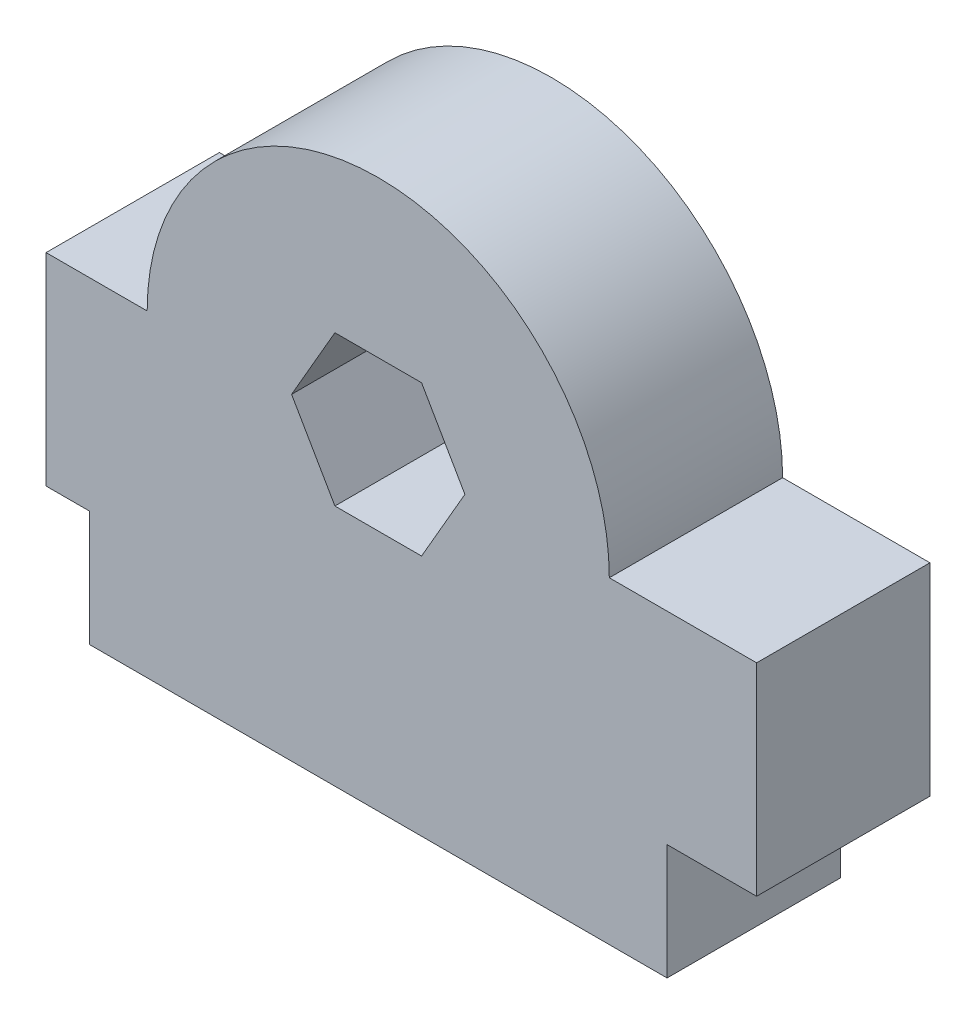
ISO-10303-21;
HEADER;
FILE_DESCRIPTION(('STEP AP214'),'2;1');
FILE_NAME('part.step','',(''),(''),'','','');
FILE_SCHEMA(('AUTOMOTIVE_DESIGN { 1 0 10303 214 1 1 1 1 }'));
ENDSEC;
DATA;
#1=APPLICATION_CONTEXT('core data for automotive mechanical design processes');
#2=APPLICATION_PROTOCOL_DEFINITION('international standard','automotive_design',2000,#1);
#3=PRODUCT_CONTEXT('',#1,'mechanical');
#4=PRODUCT('Part','Part','',(#3));
#5=PRODUCT_RELATED_PRODUCT_CATEGORY('part','',(#4));
#6=PRODUCT_DEFINITION_FORMATION('','',#4);
#7=PRODUCT_DEFINITION_CONTEXT('part definition',#1,'design');
#8=PRODUCT_DEFINITION('design','',#6,#7);
#9=PRODUCT_DEFINITION_SHAPE('','',#8);
#10=(LENGTH_UNIT() NAMED_UNIT(*) SI_UNIT(.MILLI.,.METRE.));
#11=(NAMED_UNIT(*) PLANE_ANGLE_UNIT() SI_UNIT($,.RADIAN.));
#12=(NAMED_UNIT(*) SI_UNIT($,.STERADIAN.) SOLID_ANGLE_UNIT());
#13=UNCERTAINTY_MEASURE_WITH_UNIT(LENGTH_MEASURE(1.E-05),#10,'distance_accuracy_value','');
#14=(GEOMETRIC_REPRESENTATION_CONTEXT(3) GLOBAL_UNCERTAINTY_ASSIGNED_CONTEXT((#13)) GLOBAL_UNIT_ASSIGNED_CONTEXT((#10,
#11,#12)) REPRESENTATION_CONTEXT('',''));
#15=CARTESIAN_POINT('',(0.,0.,0.));
#16=DIRECTION('',(0.,0.,1.));
#17=DIRECTION('',(1.,0.,0.));
#18=AXIS2_PLACEMENT_3D('',#15,#16,#17);
#19=CARTESIAN_POINT('',(10.,11.,6.));
#20=DIRECTION('',(0.,0.,1.));
#21=DIRECTION('',(1.,0.,0.));
#22=AXIS2_PLACEMENT_3D('',#19,#20,#21);
#23=PLANE('',#22);
#24=DIRECTION('',(0.,-1.,0.));
#25=VECTOR('',#24,1.);
#26=CARTESIAN_POINT('',(0.,0.,6.));
#27=LINE('',#26,#25);
#28=CARTESIAN_POINT('',(0.,4.,6.));
#29=VERTEX_POINT('',#28);
#30=CARTESIAN_POINT('',(0.,0.,6.));
#31=VERTEX_POINT('',#30);
#32=EDGE_CURVE('E199',#29,#31,#27,.T.);
#33=ORIENTED_EDGE('',*,*,#32,.T.);
#34=DIRECTION('',(1.,0.,0.));
#35=VECTOR('',#34,1.);
#36=CARTESIAN_POINT('',(0.,0.,6.));
#37=LINE('',#36,#35);
#38=CARTESIAN_POINT('',(20.,0.,6.));
#39=VERTEX_POINT('',#38);
#40=EDGE_CURVE('E202',#31,#39,#37,.T.);
#41=ORIENTED_EDGE('',*,*,#40,.T.);
#42=DIRECTION('',(0.,1.,0.));
#43=VECTOR('',#42,1.);
#44=CARTESIAN_POINT('',(20.,0.,6.));
#45=LINE('',#44,#43);
#46=CARTESIAN_POINT('',(20.,4.,6.));
#47=VERTEX_POINT('',#46);
#48=EDGE_CURVE('E205',#39,#47,#45,.T.);
#49=ORIENTED_EDGE('',*,*,#48,.T.);
#50=DIRECTION('',(1.,0.,0.));
#51=VECTOR('',#50,1.);
#52=CARTESIAN_POINT('',(23.1,4.,6.));
#53=LINE('',#52,#51);
#54=CARTESIAN_POINT('',(23.1,4.,6.));
#55=VERTEX_POINT('',#54);
#56=EDGE_CURVE('E207',#47,#55,#53,.T.);
#57=ORIENTED_EDGE('',*,*,#56,.T.);
#58=DIRECTION('',(0.,1.,0.));
#59=VECTOR('',#58,1.);
#60=CARTESIAN_POINT('',(23.1,11.,6.));
#61=LINE('',#60,#59);
#62=CARTESIAN_POINT('',(23.1,11.,6.));
#63=VERTEX_POINT('',#62);
#64=EDGE_CURVE('E209',#55,#63,#61,.T.);
#65=ORIENTED_EDGE('',*,*,#64,.T.);
#66=DIRECTION('',(-1.,0.,0.));
#67=VECTOR('',#66,1.);
#68=CARTESIAN_POINT('',(18.,11.,6.));
#69=LINE('',#68,#67);
#70=CARTESIAN_POINT('',(18.,11.,6.));
#71=VERTEX_POINT('',#70);
#72=EDGE_CURVE('E211',#63,#71,#69,.T.);
#73=ORIENTED_EDGE('',*,*,#72,.T.);
#74=CARTESIAN_POINT('',(10.,11.,6.));
#75=DIRECTION('',(0.,0.,1.));
#76=DIRECTION('',(1.,0.,0.));
#77=AXIS2_PLACEMENT_3D('',#74,#75,#76);
#78=CIRCLE('',#77,8.);
#79=CARTESIAN_POINT('',(2.,11.,6.));
#80=VERTEX_POINT('',#79);
#81=EDGE_CURVE('E213',#71,#80,#78,.T.);
#82=ORIENTED_EDGE('',*,*,#81,.T.);
#83=DIRECTION('',(-1.,0.,0.));
#84=VECTOR('',#83,1.);
#85=CARTESIAN_POINT('',(-1.5,11.,6.));
#86=LINE('',#85,#84);
#87=CARTESIAN_POINT('',(-1.5,11.,6.));
#88=VERTEX_POINT('',#87);
#89=EDGE_CURVE('E215',#80,#88,#86,.T.);
#90=ORIENTED_EDGE('',*,*,#89,.T.);
#91=DIRECTION('',(0.,-1.,0.));
#92=VECTOR('',#91,1.);
#93=CARTESIAN_POINT('',(-1.5,4.,6.));
#94=LINE('',#93,#92);
#95=CARTESIAN_POINT('',(-1.5,4.,6.));
#96=VERTEX_POINT('',#95);
#97=EDGE_CURVE('E217',#88,#96,#94,.T.);
#98=ORIENTED_EDGE('',*,*,#97,.T.);
#99=DIRECTION('',(1.,0.,0.));
#100=VECTOR('',#99,1.);
#101=CARTESIAN_POINT('',(0.,4.,6.));
#102=LINE('',#101,#100);
#103=EDGE_CURVE('E219',#96,#29,#102,.T.);
#104=ORIENTED_EDGE('',*,*,#103,.T.);
#105=EDGE_LOOP('',(#33,#41,#49,#57,#65,#73,#82,#90,#98,#104));
#106=FACE_BOUND('',#105,.T.);
#107=DIRECTION('',(-0.500000000000001,0.866025403784438,0.));
#108=VECTOR('',#107,1.);
#109=CARTESIAN_POINT('',(13.,11.,6.));
#110=LINE('',#109,#108);
#111=CARTESIAN_POINT('',(13.,11.,6.));
#112=VERTEX_POINT('',#111);
#113=CARTESIAN_POINT('',(11.5,13.5980762113533,6.));
#114=VERTEX_POINT('',#113);
#115=EDGE_CURVE('E156',#112,#114,#110,.T.);
#116=ORIENTED_EDGE('',*,*,#115,.F.);
#117=DIRECTION('',(0.499999999999995,0.866025403784441,0.));
#118=VECTOR('',#117,1.);
#119=CARTESIAN_POINT('',(11.5,8.4019237886467,6.));
#120=LINE('',#119,#118);
#121=CARTESIAN_POINT('',(11.5,8.4019237886467,6.));
#122=VERTEX_POINT('',#121);
#123=EDGE_CURVE('E148',#122,#112,#120,.T.);
#124=ORIENTED_EDGE('',*,*,#123,.F.);
#125=DIRECTION('',(1.,0.,0.));
#126=VECTOR('',#125,1.);
#127=CARTESIAN_POINT('',(8.50000000000002,8.40192378864667,6.));
#128=LINE('',#127,#126);
#129=CARTESIAN_POINT('',(8.50000000000002,8.40192378864667,6.));
#130=VERTEX_POINT('',#129);
#131=EDGE_CURVE('E177',#130,#122,#128,.T.);
#132=ORIENTED_EDGE('',*,*,#131,.F.);
#133=DIRECTION('',(0.500000000000007,-0.866025403784435,0.));
#134=VECTOR('',#133,1.);
#135=CARTESIAN_POINT('',(7.,11.,6.));
#136=LINE('',#135,#134);
#137=CARTESIAN_POINT('',(7.,11.,6.));
#138=VERTEX_POINT('',#137);
#139=EDGE_CURVE('E175',#138,#130,#136,.T.);
#140=ORIENTED_EDGE('',*,*,#139,.F.);
#141=DIRECTION('',(-0.499999999999995,-0.866025403784441,0.));
#142=VECTOR('',#141,1.);
#143=CARTESIAN_POINT('',(8.49999999999999,13.5980762113533,6.));
#144=LINE('',#143,#142);
#145=CARTESIAN_POINT('',(8.49999999999999,13.5980762113533,6.));
#146=VERTEX_POINT('',#145);
#147=EDGE_CURVE('E171',#146,#138,#144,.T.);
#148=ORIENTED_EDGE('',*,*,#147,.F.);
#149=DIRECTION('',(-1.,0.,0.));
#150=VECTOR('',#149,1.);
#151=CARTESIAN_POINT('',(11.5,13.5980762113533,6.));
#152=LINE('',#151,#150);
#153=EDGE_CURVE('E169',#114,#146,#152,.T.);
#154=ORIENTED_EDGE('',*,*,#153,.F.);
#155=EDGE_LOOP('',(#116,#124,#132,#140,#148,#154));
#156=FACE_BOUND('',#155,.T.);
#157=ADVANCED_FACE('F35',(#106,#156),#23,.T.);
#158=CARTESIAN_POINT('',(10.,11.,0.));
#159=DIRECTION('',(0.,0.,1.));
#160=DIRECTION('',(1.,0.,0.));
#161=AXIS2_PLACEMENT_3D('',#158,#159,#160);
#162=PLANE('',#161);
#163=DIRECTION('',(0.,-1.,0.));
#164=VECTOR('',#163,1.);
#165=CARTESIAN_POINT('',(0.,0.,0.));
#166=LINE('',#165,#164);
#167=CARTESIAN_POINT('',(0.,4.,0.));
#168=VERTEX_POINT('',#167);
#169=CARTESIAN_POINT('',(0.,0.,0.));
#170=VERTEX_POINT('',#169);
#171=EDGE_CURVE('E164',#168,#170,#166,.T.);
#172=ORIENTED_EDGE('',*,*,#171,.F.);
#173=DIRECTION('',(1.,0.,0.));
#174=VECTOR('',#173,1.);
#175=CARTESIAN_POINT('',(0.,4.,0.));
#176=LINE('',#175,#174);
#177=CARTESIAN_POINT('',(-1.5,4.,0.));
#178=VERTEX_POINT('',#177);
#179=EDGE_CURVE('E203',#178,#168,#176,.T.);
#180=ORIENTED_EDGE('',*,*,#179,.F.);
#181=DIRECTION('',(0.,-1.,0.));
#182=VECTOR('',#181,1.);
#183=CARTESIAN_POINT('',(-1.5,4.,0.));
#184=LINE('',#183,#182);
#185=CARTESIAN_POINT('',(-1.5,11.,0.));
#186=VERTEX_POINT('',#185);
#187=EDGE_CURVE('E238',#186,#178,#184,.T.);
#188=ORIENTED_EDGE('',*,*,#187,.F.);
#189=DIRECTION('',(-1.,0.,0.));
#190=VECTOR('',#189,1.);
#191=CARTESIAN_POINT('',(-1.5,11.,0.));
#192=LINE('',#191,#190);
#193=CARTESIAN_POINT('',(2.,11.,0.));
#194=VERTEX_POINT('',#193);
#195=EDGE_CURVE('E236',#194,#186,#192,.T.);
#196=ORIENTED_EDGE('',*,*,#195,.F.);
#197=CARTESIAN_POINT('',(10.,11.,0.));
#198=DIRECTION('',(0.,0.,1.));
#199=DIRECTION('',(1.,0.,0.));
#200=AXIS2_PLACEMENT_3D('',#197,#198,#199);
#201=CIRCLE('',#200,8.);
#202=CARTESIAN_POINT('',(18.,11.,0.));
#203=VERTEX_POINT('',#202);
#204=EDGE_CURVE('E234',#203,#194,#201,.T.);
#205=ORIENTED_EDGE('',*,*,#204,.F.);
#206=DIRECTION('',(-1.,0.,0.));
#207=VECTOR('',#206,1.);
#208=CARTESIAN_POINT('',(18.,11.,0.));
#209=LINE('',#208,#207);
#210=CARTESIAN_POINT('',(23.1,11.,0.));
#211=VERTEX_POINT('',#210);
#212=EDGE_CURVE('E232',#211,#203,#209,.T.);
#213=ORIENTED_EDGE('',*,*,#212,.F.);
#214=DIRECTION('',(0.,1.,0.));
#215=VECTOR('',#214,1.);
#216=CARTESIAN_POINT('',(23.1,11.,0.));
#217=LINE('',#216,#215);
#218=CARTESIAN_POINT('',(23.1,4.,0.));
#219=VERTEX_POINT('',#218);
#220=EDGE_CURVE('E230',#219,#211,#217,.T.);
#221=ORIENTED_EDGE('',*,*,#220,.F.);
#222=DIRECTION('',(1.,0.,0.));
#223=VECTOR('',#222,1.);
#224=CARTESIAN_POINT('',(23.1,4.,0.));
#225=LINE('',#224,#223);
#226=CARTESIAN_POINT('',(20.,4.,0.));
#227=VERTEX_POINT('',#226);
#228=EDGE_CURVE('E228',#227,#219,#225,.T.);
#229=ORIENTED_EDGE('',*,*,#228,.F.);
#230=DIRECTION('',(0.,1.,0.));
#231=VECTOR('',#230,1.);
#232=CARTESIAN_POINT('',(20.,0.,0.));
#233=LINE('',#232,#231);
#234=CARTESIAN_POINT('',(20.,0.,0.));
#235=VERTEX_POINT('',#234);
#236=EDGE_CURVE('E226',#235,#227,#233,.T.);
#237=ORIENTED_EDGE('',*,*,#236,.F.);
#238=DIRECTION('',(1.,0.,0.));
#239=VECTOR('',#238,1.);
#240=CARTESIAN_POINT('',(0.,0.,0.));
#241=LINE('',#240,#239);
#242=EDGE_CURVE('E224',#170,#235,#241,.T.);
#243=ORIENTED_EDGE('',*,*,#242,.F.);
#244=EDGE_LOOP('',(#172,#180,#188,#196,#205,#213,#221,#229,#237,#243));
#245=FACE_BOUND('',#244,.T.);
#246=DIRECTION('',(0.499999999999995,0.866025403784441,0.));
#247=VECTOR('',#246,1.);
#248=CARTESIAN_POINT('',(11.5,8.4019237886467,0.));
#249=LINE('',#248,#247);
#250=CARTESIAN_POINT('',(11.5,8.4019237886467,0.));
#251=VERTEX_POINT('',#250);
#252=CARTESIAN_POINT('',(13.,11.,0.));
#253=VERTEX_POINT('',#252);
#254=EDGE_CURVE('E58',#251,#253,#249,.T.);
#255=ORIENTED_EDGE('',*,*,#254,.T.);
#256=DIRECTION('',(-0.500000000000001,0.866025403784438,0.));
#257=VECTOR('',#256,1.);
#258=CARTESIAN_POINT('',(13.,11.,0.));
#259=LINE('',#258,#257);
#260=CARTESIAN_POINT('',(11.5,13.5980762113533,0.));
#261=VERTEX_POINT('',#260);
#262=EDGE_CURVE('E163',#253,#261,#259,.T.);
#263=ORIENTED_EDGE('',*,*,#262,.T.);
#264=DIRECTION('',(-1.,0.,0.));
#265=VECTOR('',#264,1.);
#266=CARTESIAN_POINT('',(11.5,13.5980762113533,0.));
#267=LINE('',#266,#265);
#268=CARTESIAN_POINT('',(8.49999999999999,13.5980762113533,0.));
#269=VERTEX_POINT('',#268);
#270=EDGE_CURVE('E181',#261,#269,#267,.T.);
#271=ORIENTED_EDGE('',*,*,#270,.T.);
#272=DIRECTION('',(-0.499999999999995,-0.866025403784441,0.));
#273=VECTOR('',#272,1.);
#274=CARTESIAN_POINT('',(8.49999999999999,13.5980762113533,0.));
#275=LINE('',#274,#273);
#276=CARTESIAN_POINT('',(7.,11.,0.));
#277=VERTEX_POINT('',#276);
#278=EDGE_CURVE('E184',#269,#277,#275,.T.);
#279=ORIENTED_EDGE('',*,*,#278,.T.);
#280=DIRECTION('',(0.500000000000007,-0.866025403784435,0.));
#281=VECTOR('',#280,1.);
#282=CARTESIAN_POINT('',(7.,11.,0.));
#283=LINE('',#282,#281);
#284=CARTESIAN_POINT('',(8.50000000000002,8.40192378864667,0.));
#285=VERTEX_POINT('',#284);
#286=EDGE_CURVE('E187',#277,#285,#283,.T.);
#287=ORIENTED_EDGE('',*,*,#286,.T.);
#288=DIRECTION('',(1.,0.,0.));
#289=VECTOR('',#288,1.);
#290=CARTESIAN_POINT('',(8.50000000000002,8.40192378864667,0.));
#291=LINE('',#290,#289);
#292=EDGE_CURVE('E157',#285,#251,#291,.T.);
#293=ORIENTED_EDGE('',*,*,#292,.T.);
#294=EDGE_LOOP('',(#255,#263,#271,#279,#287,#293));
#295=FACE_BOUND('',#294,.T.);
#296=ADVANCED_FACE('F274',(#245,#295),#162,.F.);
#297=CARTESIAN_POINT('',(0.,0.,6.));
#298=DIRECTION('',(1.,0.,0.));
#299=DIRECTION('',(0.,0.,-1.));
#300=AXIS2_PLACEMENT_3D('',#297,#298,#299);
#301=PLANE('',#300);
#302=ORIENTED_EDGE('',*,*,#171,.T.);
#303=DIRECTION('',(0.,0.,-1.));
#304=VECTOR('',#303,1.);
#305=CARTESIAN_POINT('',(0.,0.,6.));
#306=LINE('',#305,#304);
#307=EDGE_CURVE('E11',#31,#170,#306,.T.);
#308=ORIENTED_EDGE('',*,*,#307,.F.);
#309=ORIENTED_EDGE('',*,*,#32,.F.);
#310=DIRECTION('',(0.,0.,-1.));
#311=VECTOR('',#310,1.);
#312=CARTESIAN_POINT('',(0.,4.,6.));
#313=LINE('',#312,#311);
#314=EDGE_CURVE('E221',#29,#168,#313,.T.);
#315=ORIENTED_EDGE('',*,*,#314,.T.);
#316=EDGE_LOOP('',(#302,#308,#309,#315));
#317=FACE_BOUND('',#316,.T.);
#318=ADVANCED_FACE('F37',(#317),#301,.F.);
#319=CARTESIAN_POINT('',(0.,0.,6.));
#320=DIRECTION('',(0.,1.,0.));
#321=DIRECTION('',(0.,0.,1.));
#322=AXIS2_PLACEMENT_3D('',#319,#320,#321);
#323=PLANE('',#322);
#324=ORIENTED_EDGE('',*,*,#242,.T.);
#325=DIRECTION('',(0.,0.,-1.));
#326=VECTOR('',#325,1.);
#327=CARTESIAN_POINT('',(20.,0.,6.));
#328=LINE('',#327,#326);
#329=EDGE_CURVE('E43',#39,#235,#328,.T.);
#330=ORIENTED_EDGE('',*,*,#329,.F.);
#331=ORIENTED_EDGE('',*,*,#40,.F.);
#332=ORIENTED_EDGE('',*,*,#307,.T.);
#333=EDGE_LOOP('',(#324,#330,#331,#332));
#334=FACE_BOUND('',#333,.T.);
#335=ADVANCED_FACE('F291',(#334),#323,.F.);
#336=CARTESIAN_POINT('',(20.,0.,6.));
#337=DIRECTION('',(-1.,0.,0.));
#338=DIRECTION('',(0.,0.,1.));
#339=AXIS2_PLACEMENT_3D('',#336,#337,#338);
#340=PLANE('',#339);
#341=ORIENTED_EDGE('',*,*,#236,.T.);
#342=DIRECTION('',(0.,0.,-1.));
#343=VECTOR('',#342,1.);
#344=CARTESIAN_POINT('',(20.,4.,6.));
#345=LINE('',#344,#343);
#346=EDGE_CURVE('E261',#47,#227,#345,.T.);
#347=ORIENTED_EDGE('',*,*,#346,.F.);
#348=ORIENTED_EDGE('',*,*,#48,.F.);
#349=ORIENTED_EDGE('',*,*,#329,.T.);
#350=EDGE_LOOP('',(#341,#347,#348,#349));
#351=FACE_BOUND('',#350,.T.);
#352=ADVANCED_FACE('F268',(#351),#340,.F.);
#353=CARTESIAN_POINT('',(23.1,4.,6.));
#354=DIRECTION('',(0.,1.,0.));
#355=DIRECTION('',(-1.,0.,0.));
#356=AXIS2_PLACEMENT_3D('',#353,#354,#355);
#357=PLANE('',#356);
#358=ORIENTED_EDGE('',*,*,#228,.T.);
#359=DIRECTION('',(0.,0.,-1.));
#360=VECTOR('',#359,1.);
#361=CARTESIAN_POINT('',(23.1,4.,6.));
#362=LINE('',#361,#360);
#363=EDGE_CURVE('E258',#55,#219,#362,.T.);
#364=ORIENTED_EDGE('',*,*,#363,.F.);
#365=ORIENTED_EDGE('',*,*,#56,.F.);
#366=ORIENTED_EDGE('',*,*,#346,.T.);
#367=EDGE_LOOP('',(#358,#364,#365,#366));
#368=FACE_BOUND('',#367,.T.);
#369=ADVANCED_FACE('F280',(#368),#357,.F.);
#370=CARTESIAN_POINT('',(23.1,11.,6.));
#371=DIRECTION('',(-1.,0.,0.));
#372=DIRECTION('',(0.,0.,1.));
#373=AXIS2_PLACEMENT_3D('',#370,#371,#372);
#374=PLANE('',#373);
#375=ORIENTED_EDGE('',*,*,#220,.T.);
#376=DIRECTION('',(0.,0.,-1.));
#377=VECTOR('',#376,1.);
#378=CARTESIAN_POINT('',(23.1,11.,6.));
#379=LINE('',#378,#377);
#380=EDGE_CURVE('E255',#63,#211,#379,.T.);
#381=ORIENTED_EDGE('',*,*,#380,.F.);
#382=ORIENTED_EDGE('',*,*,#64,.F.);
#383=ORIENTED_EDGE('',*,*,#363,.T.);
#384=EDGE_LOOP('',(#375,#381,#382,#383));
#385=FACE_BOUND('',#384,.T.);
#386=ADVANCED_FACE('F284',(#385),#374,.F.);
#387=CARTESIAN_POINT('',(18.,11.,6.));
#388=DIRECTION('',(0.,-1.,0.));
#389=DIRECTION('',(1.,0.,0.));
#390=AXIS2_PLACEMENT_3D('',#387,#388,#389);
#391=PLANE('',#390);
#392=ORIENTED_EDGE('',*,*,#212,.T.);
#393=DIRECTION('',(0.,0.,-1.));
#394=VECTOR('',#393,1.);
#395=CARTESIAN_POINT('',(18.,11.,6.));
#396=LINE('',#395,#394);
#397=EDGE_CURVE('E252',#71,#203,#396,.T.);
#398=ORIENTED_EDGE('',*,*,#397,.F.);
#399=ORIENTED_EDGE('',*,*,#72,.F.);
#400=ORIENTED_EDGE('',*,*,#380,.T.);
#401=EDGE_LOOP('',(#392,#398,#399,#400));
#402=FACE_BOUND('',#401,.T.);
#403=ADVANCED_FACE('F314',(#402),#391,.F.);
#404=CARTESIAN_POINT('',(10.,11.,6.));
#405=DIRECTION('',(0.,0.,-1.));
#406=DIRECTION('',(-1.,0.,0.));
#407=AXIS2_PLACEMENT_3D('',#404,#405,#406);
#408=CYLINDRICAL_SURFACE('',#407,8.);
#409=ORIENTED_EDGE('',*,*,#204,.T.);
#410=DIRECTION('',(0.,0.,-1.));
#411=VECTOR('',#410,1.);
#412=CARTESIAN_POINT('',(2.,11.,6.));
#413=LINE('',#412,#411);
#414=EDGE_CURVE('E249',#80,#194,#413,.T.);
#415=ORIENTED_EDGE('',*,*,#414,.F.);
#416=ORIENTED_EDGE('',*,*,#81,.F.);
#417=ORIENTED_EDGE('',*,*,#397,.T.);
#418=EDGE_LOOP('',(#409,#415,#416,#417));
#419=FACE_BOUND('',#418,.T.);
#420=ADVANCED_FACE('F311',(#419),#408,.T.);
#421=CARTESIAN_POINT('',(-1.5,11.,6.));
#422=DIRECTION('',(0.,-1.,0.));
#423=DIRECTION('',(0.,0.,-1.));
#424=AXIS2_PLACEMENT_3D('',#421,#422,#423);
#425=PLANE('',#424);
#426=ORIENTED_EDGE('',*,*,#195,.T.);
#427=DIRECTION('',(0.,0.,-1.));
#428=VECTOR('',#427,1.);
#429=CARTESIAN_POINT('',(-1.5,11.,6.));
#430=LINE('',#429,#428);
#431=EDGE_CURVE('E246',#88,#186,#430,.T.);
#432=ORIENTED_EDGE('',*,*,#431,.F.);
#433=ORIENTED_EDGE('',*,*,#89,.F.);
#434=ORIENTED_EDGE('',*,*,#414,.T.);
#435=EDGE_LOOP('',(#426,#432,#433,#434));
#436=FACE_BOUND('',#435,.T.);
#437=ADVANCED_FACE('F307',(#436),#425,.F.);
#438=CARTESIAN_POINT('',(-1.5,4.,6.));
#439=DIRECTION('',(1.,0.,0.));
#440=DIRECTION('',(0.,0.,-1.));
#441=AXIS2_PLACEMENT_3D('',#438,#439,#440);
#442=PLANE('',#441);
#443=ORIENTED_EDGE('',*,*,#187,.T.);
#444=DIRECTION('',(0.,0.,-1.));
#445=VECTOR('',#444,1.);
#446=CARTESIAN_POINT('',(-1.5,4.,6.));
#447=LINE('',#446,#445);
#448=EDGE_CURVE('E243',#96,#178,#447,.T.);
#449=ORIENTED_EDGE('',*,*,#448,.F.);
#450=ORIENTED_EDGE('',*,*,#97,.F.);
#451=ORIENTED_EDGE('',*,*,#431,.T.);
#452=EDGE_LOOP('',(#443,#449,#450,#451));
#453=FACE_BOUND('',#452,.T.);
#454=ADVANCED_FACE('F303',(#453),#442,.F.);
#455=CARTESIAN_POINT('',(0.,4.,6.));
#456=DIRECTION('',(0.,1.,0.));
#457=DIRECTION('',(0.,0.,1.));
#458=AXIS2_PLACEMENT_3D('',#455,#456,#457);
#459=PLANE('',#458);
#460=ORIENTED_EDGE('',*,*,#179,.T.);
#461=ORIENTED_EDGE('',*,*,#314,.F.);
#462=ORIENTED_EDGE('',*,*,#103,.F.);
#463=ORIENTED_EDGE('',*,*,#448,.T.);
#464=EDGE_LOOP('',(#460,#461,#462,#463));
#465=FACE_BOUND('',#464,.T.);
#466=ADVANCED_FACE('F298',(#465),#459,.F.);
#467=CARTESIAN_POINT('',(11.5,8.4019237886467,6.));
#468=DIRECTION('',(-0.866025403784442,0.499999999999995,0.));
#469=DIRECTION('',(-0.499999999999995,-0.866025403784442,0.));
#470=AXIS2_PLACEMENT_3D('',#467,#468,#469);
#471=PLANE('',#470);
#472=ORIENTED_EDGE('',*,*,#254,.F.);
#473=DIRECTION('',(0.,0.,-1.));
#474=VECTOR('',#473,1.);
#475=CARTESIAN_POINT('',(11.5,8.4019237886467,6.));
#476=LINE('',#475,#474);
#477=EDGE_CURVE('E152',#122,#251,#476,.T.);
#478=ORIENTED_EDGE('',*,*,#477,.F.);
#479=ORIENTED_EDGE('',*,*,#123,.T.);
#480=DIRECTION('',(0.,0.,-1.));
#481=VECTOR('',#480,1.);
#482=CARTESIAN_POINT('',(13.,11.,6.));
#483=LINE('',#482,#481);
#484=EDGE_CURVE('E151',#112,#253,#483,.T.);
#485=ORIENTED_EDGE('',*,*,#484,.T.);
#486=EDGE_LOOP('',(#472,#478,#479,#485));
#487=FACE_BOUND('',#486,.T.);
#488=ADVANCED_FACE('F150',(#487),#471,.T.);
#489=CARTESIAN_POINT('',(13.,11.,6.));
#490=DIRECTION('',(-0.866025403784438,-0.500000000000001,0.));
#491=DIRECTION('',(0.500000000000001,-0.866025403784438,0.));
#492=AXIS2_PLACEMENT_3D('',#489,#490,#491);
#493=PLANE('',#492);
#494=ORIENTED_EDGE('',*,*,#262,.F.);
#495=ORIENTED_EDGE('',*,*,#484,.F.);
#496=ORIENTED_EDGE('',*,*,#115,.T.);
#497=DIRECTION('',(0.,0.,-1.));
#498=VECTOR('',#497,1.);
#499=CARTESIAN_POINT('',(11.5,13.5980762113533,6.));
#500=LINE('',#499,#498);
#501=EDGE_CURVE('E165',#114,#261,#500,.T.);
#502=ORIENTED_EDGE('',*,*,#501,.T.);
#503=EDGE_LOOP('',(#494,#495,#496,#502));
#504=FACE_BOUND('',#503,.T.);
#505=ADVANCED_FACE('F160',(#504),#493,.T.);
#506=CARTESIAN_POINT('',(11.5,13.5980762113533,6.));
#507=DIRECTION('',(0.,-1.,0.));
#508=DIRECTION('',(1.,0.,0.));
#509=AXIS2_PLACEMENT_3D('',#506,#507,#508);
#510=PLANE('',#509);
#511=ORIENTED_EDGE('',*,*,#270,.F.);
#512=ORIENTED_EDGE('',*,*,#501,.F.);
#513=ORIENTED_EDGE('',*,*,#153,.T.);
#514=DIRECTION('',(0.,0.,-1.));
#515=VECTOR('',#514,1.);
#516=CARTESIAN_POINT('',(8.49999999999999,13.5980762113533,6.));
#517=LINE('',#516,#515);
#518=EDGE_CURVE('E196',#146,#269,#517,.T.);
#519=ORIENTED_EDGE('',*,*,#518,.T.);
#520=EDGE_LOOP('',(#511,#512,#513,#519));
#521=FACE_BOUND('',#520,.T.);
#522=ADVANCED_FACE('F360',(#521),#510,.T.);
#523=CARTESIAN_POINT('',(8.49999999999999,13.5980762113533,6.));
#524=DIRECTION('',(0.866025403784441,-0.499999999999995,0.));
#525=DIRECTION('',(0.499999999999995,0.866025403784441,0.));
#526=AXIS2_PLACEMENT_3D('',#523,#524,#525);
#527=PLANE('',#526);
#528=ORIENTED_EDGE('',*,*,#278,.F.);
#529=ORIENTED_EDGE('',*,*,#518,.F.);
#530=ORIENTED_EDGE('',*,*,#147,.T.);
#531=DIRECTION('',(0.,0.,-1.));
#532=VECTOR('',#531,1.);
#533=CARTESIAN_POINT('',(7.,11.,6.));
#534=LINE('',#533,#532);
#535=EDGE_CURVE('E194',#138,#277,#534,.T.);
#536=ORIENTED_EDGE('',*,*,#535,.T.);
#537=EDGE_LOOP('',(#528,#529,#530,#536));
#538=FACE_BOUND('',#537,.T.);
#539=ADVANCED_FACE('F366',(#538),#527,.T.);
#540=CARTESIAN_POINT('',(7.,11.,6.));
#541=DIRECTION('',(0.866025403784435,0.500000000000007,0.));
#542=DIRECTION('',(-0.500000000000007,0.866025403784435,0.));
#543=AXIS2_PLACEMENT_3D('',#540,#541,#542);
#544=PLANE('',#543);
#545=ORIENTED_EDGE('',*,*,#286,.F.);
#546=ORIENTED_EDGE('',*,*,#535,.F.);
#547=ORIENTED_EDGE('',*,*,#139,.T.);
#548=DIRECTION('',(0.,0.,-1.));
#549=VECTOR('',#548,1.);
#550=CARTESIAN_POINT('',(8.50000000000002,8.40192378864667,6.));
#551=LINE('',#550,#549);
#552=EDGE_CURVE('E50',#130,#285,#551,.T.);
#553=ORIENTED_EDGE('',*,*,#552,.T.);
#554=EDGE_LOOP('',(#545,#546,#547,#553));
#555=FACE_BOUND('',#554,.T.);
#556=ADVANCED_FACE('F374',(#555),#544,.T.);
#557=CARTESIAN_POINT('',(8.50000000000002,8.40192378864667,6.));
#558=DIRECTION('',(0.,1.,0.));
#559=DIRECTION('',(-1.,0.,0.));
#560=AXIS2_PLACEMENT_3D('',#557,#558,#559);
#561=PLANE('',#560);
#562=ORIENTED_EDGE('',*,*,#292,.F.);
#563=ORIENTED_EDGE('',*,*,#552,.F.);
#564=ORIENTED_EDGE('',*,*,#131,.T.);
#565=ORIENTED_EDGE('',*,*,#477,.T.);
#566=EDGE_LOOP('',(#562,#563,#564,#565));
#567=FACE_BOUND('',#566,.T.);
#568=ADVANCED_FACE('F382',(#567),#561,.T.);
#569=CLOSED_SHELL('',(#157,#296,#318,#335,#352,#369,#386,#403,#420,#437,#454,#466,#488,#505,
#522,#539,#556,#568));
#570=MANIFOLD_SOLID_BREP('B2',#569);
#571=ADVANCED_BREP_SHAPE_REPRESENTATION('',(#18,#570),#14);
#572=SHAPE_DEFINITION_REPRESENTATION(#9,#571);
ENDSEC;
END-ISO-10303-21;
